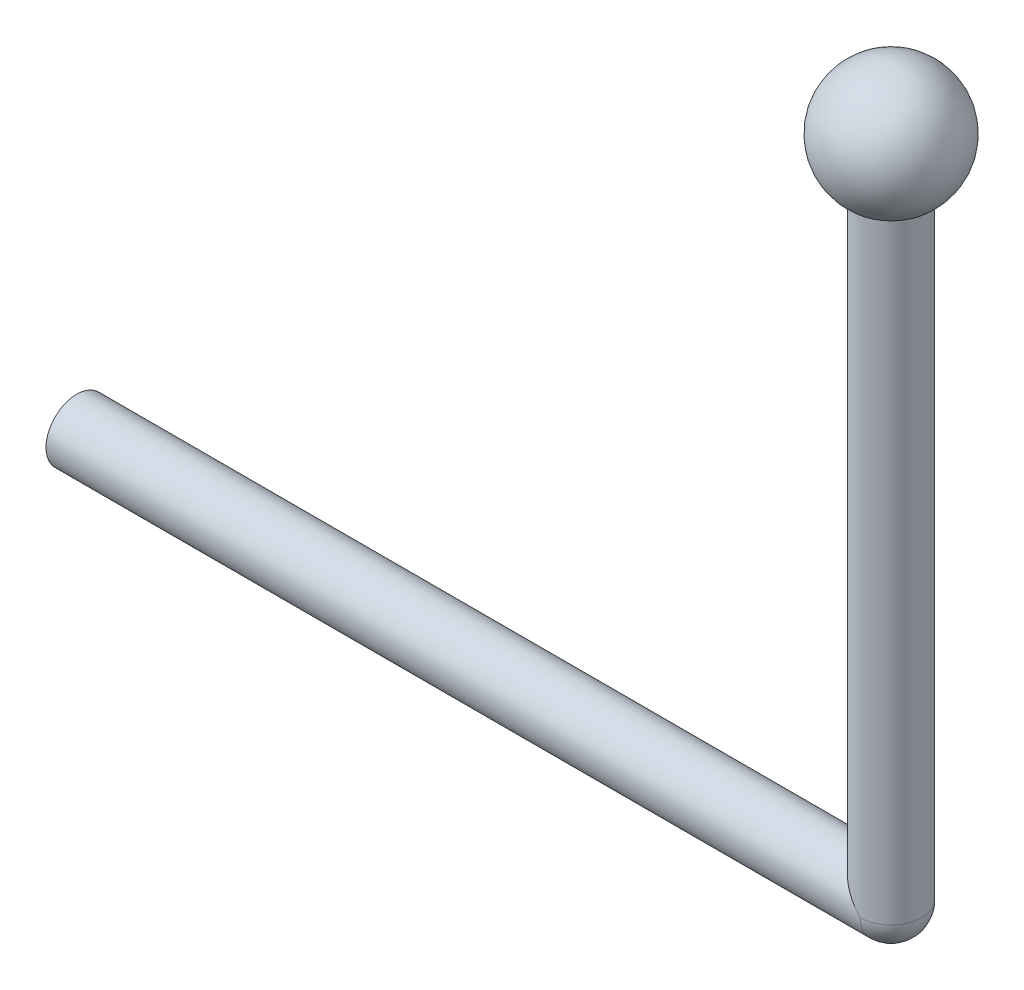
ISO-10303-21;
HEADER;
FILE_DESCRIPTION(('STEP AP214'),'2;1');
FILE_NAME('part.step','',(''),(''),'','','');
FILE_SCHEMA(('AUTOMOTIVE_DESIGN { 1 0 10303 214 1 1 1 1 }'));
ENDSEC;
DATA;
#1=APPLICATION_CONTEXT('core data for automotive mechanical design processes');
#2=APPLICATION_PROTOCOL_DEFINITION('international standard','automotive_design',2000,#1);
#3=PRODUCT_CONTEXT('',#1,'mechanical');
#4=PRODUCT('Part','Part','',(#3));
#5=PRODUCT_RELATED_PRODUCT_CATEGORY('part','',(#4));
#6=PRODUCT_DEFINITION_FORMATION('','',#4);
#7=PRODUCT_DEFINITION_CONTEXT('part definition',#1,'design');
#8=PRODUCT_DEFINITION('design','',#6,#7);
#9=PRODUCT_DEFINITION_SHAPE('','',#8);
#10=(LENGTH_UNIT() NAMED_UNIT(*) SI_UNIT(.MILLI.,.METRE.));
#11=(NAMED_UNIT(*) PLANE_ANGLE_UNIT() SI_UNIT($,.RADIAN.));
#12=(NAMED_UNIT(*) SI_UNIT($,.STERADIAN.) SOLID_ANGLE_UNIT());
#13=UNCERTAINTY_MEASURE_WITH_UNIT(LENGTH_MEASURE(1.E-05),#10,'distance_accuracy_value','');
#14=(GEOMETRIC_REPRESENTATION_CONTEXT(3) GLOBAL_UNCERTAINTY_ASSIGNED_CONTEXT((#13)) GLOBAL_UNIT_ASSIGNED_CONTEXT((#10,
#11,#12)) REPRESENTATION_CONTEXT('',''));
#15=CARTESIAN_POINT('',(0.,0.,0.));
#16=DIRECTION('',(0.,0.,1.));
#17=DIRECTION('',(1.,0.,0.));
#18=AXIS2_PLACEMENT_3D('',#15,#16,#17);
#19=CARTESIAN_POINT('',(0.,0.,0.));
#20=DIRECTION('',(0.,1.,0.));
#21=DIRECTION('',(1.,0.,0.));
#22=AXIS2_PLACEMENT_3D('',#19,#20,#21);
#23=SPHERICAL_SURFACE('',#22,4.);
#24=CARTESIAN_POINT('',(0.,-3.46410161513775,0.));
#25=DIRECTION('',(0.,1.,0.));
#26=DIRECTION('',(-1.,0.,0.));
#27=AXIS2_PLACEMENT_3D('',#24,#25,#26);
#28=CIRCLE('',#27,2.);
#29=CARTESIAN_POINT('',(-2.,-3.46410161513775,0.));
#30=VERTEX_POINT('',#29);
#31=EDGE_CURVE('E11',#30,#30,#28,.F.);
#32=ORIENTED_EDGE('',*,*,#31,.F.);
#33=EDGE_LOOP('',(#32));
#34=FACE_BOUND('',#33,.T.);
#35=ADVANCED_FACE('F37',(#34),#23,.T.);
#36=CARTESIAN_POINT('',(0.,-2.,0.));
#37=DIRECTION('',(0.,1.,0.));
#38=DIRECTION('',(-1.,0.,0.));
#39=AXIS2_PLACEMENT_3D('',#36,#37,#38);
#40=CYLINDRICAL_SURFACE('',#39,2.);
#41=CARTESIAN_POINT('',(0.,-43.,0.));
#42=DIRECTION('',(0.707106781186547,0.707106781186548,0.));
#43=DIRECTION('',(-0.707106781186548,0.707106781186547,0.));
#44=AXIS2_PLACEMENT_3D('',#41,#42,#43);
#45=ELLIPSE('',#44,2.82842712474619,2.);
#46=CARTESIAN_POINT('',(0.,-43.,2.));
#47=VERTEX_POINT('',#46);
#48=CARTESIAN_POINT('',(0.,-43.,-2.));
#49=VERTEX_POINT('',#48);
#50=EDGE_CURVE('E56',#47,#49,#45,.F.);
#51=ORIENTED_EDGE('',*,*,#50,.F.);
#52=CARTESIAN_POINT('',(0.,-43.,0.));
#53=DIRECTION('',(0.,1.,0.));
#54=DIRECTION('',(-1.,0.,0.));
#55=AXIS2_PLACEMENT_3D('',#52,#53,#54);
#56=CIRCLE('',#55,2.);
#57=EDGE_CURVE('E44',#47,#49,#56,.T.);
#58=ORIENTED_EDGE('',*,*,#57,.T.);
#59=EDGE_LOOP('',(#51,#58));
#60=FACE_BOUND('',#59,.T.);
#61=ORIENTED_EDGE('',*,*,#31,.T.);
#62=EDGE_LOOP('',(#61));
#63=FACE_BOUND('',#62,.T.);
#64=ADVANCED_FACE('F61',(#60,#63),#40,.T.);
#65=CARTESIAN_POINT('',(-52.7788140480538,-43.,-45.6504258492871));
#66=DIRECTION('',(-1.,0.,0.));
#67=DIRECTION('',(0.,-1.,0.));
#68=AXIS2_PLACEMENT_3D('',#65,#66,#67);
#69=PLANE('',#68);
#70=CARTESIAN_POINT('',(-52.7788140480538,-43.,0.));
#71=DIRECTION('',(1.,0.,0.));
#72=DIRECTION('',(0.,1.,0.));
#73=AXIS2_PLACEMENT_3D('',#70,#71,#72);
#74=CIRCLE('',#73,2.);
#75=CARTESIAN_POINT('',(-52.7788140480538,-41.,0.));
#76=VERTEX_POINT('',#75);
#77=EDGE_CURVE('E59',#76,#76,#74,.T.);
#78=ORIENTED_EDGE('',*,*,#77,.F.);
#79=EDGE_LOOP('',(#78));
#80=FACE_BOUND('',#79,.T.);
#81=ADVANCED_FACE('F69',(#80),#69,.T.);
#82=CARTESIAN_POINT('',(-0.493950762802337,-43.,0.));
#83=DIRECTION('',(1.,0.,0.));
#84=DIRECTION('',(0.,1.,0.));
#85=AXIS2_PLACEMENT_3D('',#82,#83,#84);
#86=CYLINDRICAL_SURFACE('',#85,2.);
#87=ORIENTED_EDGE('',*,*,#77,.T.);
#88=EDGE_LOOP('',(#87));
#89=FACE_BOUND('',#88,.T.);
#90=CARTESIAN_POINT('',(0.,-43.,0.));
#91=DIRECTION('',(1.,0.,0.));
#92=DIRECTION('',(0.,1.,0.));
#93=AXIS2_PLACEMENT_3D('',#90,#91,#92);
#94=CIRCLE('',#93,2.);
#95=EDGE_CURVE('E50',#47,#49,#94,.T.);
#96=ORIENTED_EDGE('',*,*,#95,.F.);
#97=ORIENTED_EDGE('',*,*,#50,.T.);
#98=EDGE_LOOP('',(#96,#97));
#99=FACE_BOUND('',#98,.T.);
#100=ADVANCED_FACE('F58',(#89,#99),#86,.T.);
#101=CARTESIAN_POINT('',(0.,-43.,0.));
#102=DIRECTION('',(1.,0.,0.));
#103=DIRECTION('',(0.,0.,-1.));
#104=AXIS2_PLACEMENT_3D('',#101,#102,#103);
#105=SPHERICAL_SURFACE('',#104,2.);
#106=ORIENTED_EDGE('',*,*,#95,.T.);
#107=ORIENTED_EDGE('',*,*,#57,.F.);
#108=EDGE_LOOP('',(#106,#107));
#109=FACE_BOUND('',#108,.T.);
#110=ADVANCED_FACE('F53',(#109),#105,.T.);
#111=CLOSED_SHELL('',(#35,#64,#81,#100,#110));
#112=MANIFOLD_SOLID_BREP('B2',#111);
#113=ADVANCED_BREP_SHAPE_REPRESENTATION('',(#18,#112),#14);
#114=SHAPE_DEFINITION_REPRESENTATION(#9,#113);
ENDSEC;
END-ISO-10303-21;
